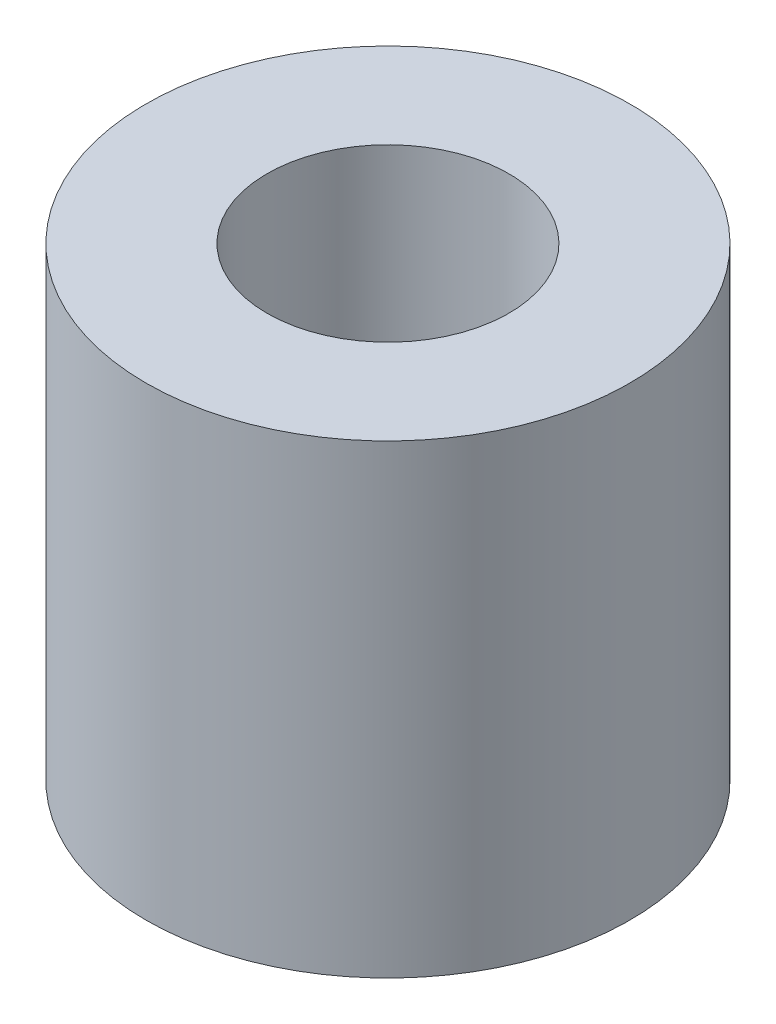
ISO-10303-21;
HEADER;
FILE_DESCRIPTION(('STEP AP214'),'2;1');
FILE_NAME('part.step','',(''),(''),'','','');
FILE_SCHEMA(('AUTOMOTIVE_DESIGN { 1 0 10303 214 1 1 1 1 }'));
ENDSEC;
DATA;
#1=APPLICATION_CONTEXT('core data for automotive mechanical design processes');
#2=APPLICATION_PROTOCOL_DEFINITION('international standard','automotive_design',2000,#1);
#3=PRODUCT_CONTEXT('',#1,'mechanical');
#4=PRODUCT('Part','Part','',(#3));
#5=PRODUCT_RELATED_PRODUCT_CATEGORY('part','',(#4));
#6=PRODUCT_DEFINITION_FORMATION('','',#4);
#7=PRODUCT_DEFINITION_CONTEXT('part definition',#1,'design');
#8=PRODUCT_DEFINITION('design','',#6,#7);
#9=PRODUCT_DEFINITION_SHAPE('','',#8);
#10=(LENGTH_UNIT() NAMED_UNIT(*) SI_UNIT(.MILLI.,.METRE.));
#11=(NAMED_UNIT(*) PLANE_ANGLE_UNIT() SI_UNIT($,.RADIAN.));
#12=(NAMED_UNIT(*) SI_UNIT($,.STERADIAN.) SOLID_ANGLE_UNIT());
#13=UNCERTAINTY_MEASURE_WITH_UNIT(LENGTH_MEASURE(1.E-05),#10,'distance_accuracy_value','');
#14=(GEOMETRIC_REPRESENTATION_CONTEXT(3) GLOBAL_UNCERTAINTY_ASSIGNED_CONTEXT((#13)) GLOBAL_UNIT_ASSIGNED_CONTEXT((#10,
#11,#12)) REPRESENTATION_CONTEXT('',''));
#15=CARTESIAN_POINT('',(0.,0.,0.));
#16=DIRECTION('',(0.,0.,1.));
#17=DIRECTION('',(1.,0.,0.));
#18=AXIS2_PLACEMENT_3D('',#15,#16,#17);
#19=CARTESIAN_POINT('',(0.,12.7,0.));
#20=DIRECTION('',(0.,1.,0.));
#21=DIRECTION('',(0.,0.,1.));
#22=AXIS2_PLACEMENT_3D('',#19,#20,#21);
#23=PLANE('',#22);
#24=CARTESIAN_POINT('',(0.,12.7,0.));
#25=DIRECTION('',(0.,1.,0.));
#26=DIRECTION('',(0.,0.,1.));
#27=AXIS2_PLACEMENT_3D('',#24,#25,#26);
#28=CIRCLE('',#27,6.604);
#29=CARTESIAN_POINT('',(0.,12.7,6.604));
#30=VERTEX_POINT('',#29);
#31=EDGE_CURVE('E10',#30,#30,#28,.T.);
#32=ORIENTED_EDGE('',*,*,#31,.T.);
#33=EDGE_LOOP('',(#32));
#34=FACE_BOUND('',#33,.T.);
#35=CARTESIAN_POINT('',(0.,12.7,0.));
#36=DIRECTION('',(0.,1.,0.));
#37=DIRECTION('',(0.,0.,1.));
#38=AXIS2_PLACEMENT_3D('',#35,#36,#37);
#39=CIRCLE('',#38,3.302);
#40=CARTESIAN_POINT('',(0.,12.7,3.302));
#41=VERTEX_POINT('',#40);
#42=EDGE_CURVE('E42',#41,#41,#39,.T.);
#43=ORIENTED_EDGE('',*,*,#42,.F.);
#44=EDGE_LOOP('',(#43));
#45=FACE_BOUND('',#44,.T.);
#46=ADVANCED_FACE('F31',(#34,#45),#23,.T.);
#47=CARTESIAN_POINT('',(0.,0.,0.));
#48=DIRECTION('',(0.,1.,0.));
#49=DIRECTION('',(0.,0.,1.));
#50=AXIS2_PLACEMENT_3D('',#47,#48,#49);
#51=PLANE('',#50);
#52=CARTESIAN_POINT('',(0.,0.,0.));
#53=DIRECTION('',(0.,1.,0.));
#54=DIRECTION('',(0.,0.,1.));
#55=AXIS2_PLACEMENT_3D('',#52,#53,#54);
#56=CIRCLE('',#55,6.604);
#57=CARTESIAN_POINT('',(0.,0.,6.604));
#58=VERTEX_POINT('',#57);
#59=EDGE_CURVE('E35',#58,#58,#56,.T.);
#60=ORIENTED_EDGE('',*,*,#59,.F.);
#61=EDGE_LOOP('',(#60));
#62=FACE_BOUND('',#61,.T.);
#63=CARTESIAN_POINT('',(0.,0.,0.));
#64=DIRECTION('',(0.,1.,0.));
#65=DIRECTION('',(0.,0.,1.));
#66=AXIS2_PLACEMENT_3D('',#63,#64,#65);
#67=CIRCLE('',#66,3.302);
#68=CARTESIAN_POINT('',(0.,0.,3.302));
#69=VERTEX_POINT('',#68);
#70=EDGE_CURVE('E44',#69,#69,#67,.T.);
#71=ORIENTED_EDGE('',*,*,#70,.T.);
#72=EDGE_LOOP('',(#71));
#73=FACE_BOUND('',#72,.T.);
#74=ADVANCED_FACE('F54',(#62,#73),#51,.F.);
#75=CARTESIAN_POINT('',(0.,12.7,0.));
#76=DIRECTION('',(0.,-1.,0.));
#77=DIRECTION('',(0.,0.,-1.));
#78=AXIS2_PLACEMENT_3D('',#75,#76,#77);
#79=CYLINDRICAL_SURFACE('',#78,6.604);
#80=ORIENTED_EDGE('',*,*,#31,.F.);
#81=EDGE_LOOP('',(#80));
#82=FACE_BOUND('',#81,.T.);
#83=ORIENTED_EDGE('',*,*,#59,.T.);
#84=EDGE_LOOP('',(#83));
#85=FACE_BOUND('',#84,.T.);
#86=ADVANCED_FACE('F33',(#82,#85),#79,.T.);
#87=CARTESIAN_POINT('',(0.,12.7,0.));
#88=DIRECTION('',(0.,-1.,0.));
#89=DIRECTION('',(0.,0.,-1.));
#90=AXIS2_PLACEMENT_3D('',#87,#88,#89);
#91=CYLINDRICAL_SURFACE('',#90,3.302);
#92=ORIENTED_EDGE('',*,*,#42,.T.);
#93=EDGE_LOOP('',(#92));
#94=FACE_BOUND('',#93,.T.);
#95=ORIENTED_EDGE('',*,*,#70,.F.);
#96=EDGE_LOOP('',(#95));
#97=FACE_BOUND('',#96,.T.);
#98=ADVANCED_FACE('F50',(#94,#97),#91,.F.);
#99=CLOSED_SHELL('',(#46,#74,#86,#98));
#100=MANIFOLD_SOLID_BREP('B2',#99);
#101=ADVANCED_BREP_SHAPE_REPRESENTATION('',(#18,#100),#14);
#102=SHAPE_DEFINITION_REPRESENTATION(#9,#101);
ENDSEC;
END-ISO-10303-21;
